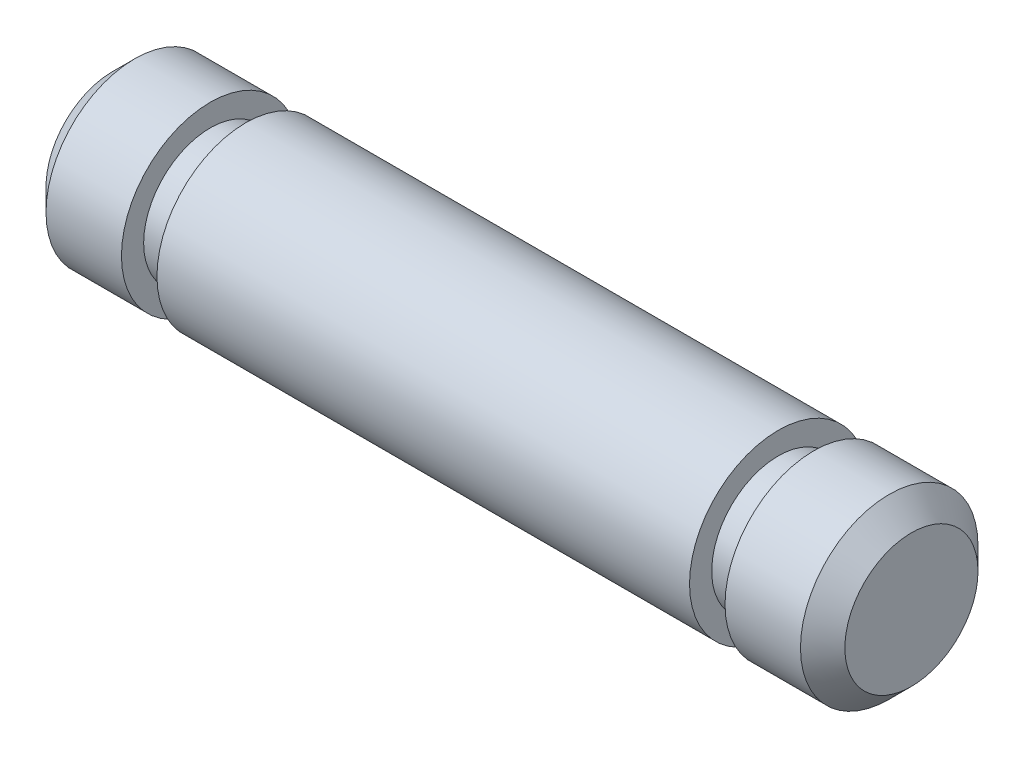
ISO-10303-21;
HEADER;
FILE_DESCRIPTION(('STEP AP214'),'2;1');
FILE_NAME('part.step','',(''),(''),'','','');
FILE_SCHEMA(('AUTOMOTIVE_DESIGN { 1 0 10303 214 1 1 1 1 }'));
ENDSEC;
DATA;
#1=APPLICATION_CONTEXT('core data for automotive mechanical design processes');
#2=APPLICATION_PROTOCOL_DEFINITION('international standard','automotive_design',2000,#1);
#3=PRODUCT_CONTEXT('',#1,'mechanical');
#4=PRODUCT('Part','Part','',(#3));
#5=PRODUCT_RELATED_PRODUCT_CATEGORY('part','',(#4));
#6=PRODUCT_DEFINITION_FORMATION('','',#4);
#7=PRODUCT_DEFINITION_CONTEXT('part definition',#1,'design');
#8=PRODUCT_DEFINITION('design','',#6,#7);
#9=PRODUCT_DEFINITION_SHAPE('','',#8);
#10=(LENGTH_UNIT() NAMED_UNIT(*) SI_UNIT(.MILLI.,.METRE.));
#11=(NAMED_UNIT(*) PLANE_ANGLE_UNIT() SI_UNIT($,.RADIAN.));
#12=(NAMED_UNIT(*) SI_UNIT($,.STERADIAN.) SOLID_ANGLE_UNIT());
#13=UNCERTAINTY_MEASURE_WITH_UNIT(LENGTH_MEASURE(1.E-05),#10,'distance_accuracy_value','');
#14=(GEOMETRIC_REPRESENTATION_CONTEXT(3) GLOBAL_UNCERTAINTY_ASSIGNED_CONTEXT((#13)) GLOBAL_UNIT_ASSIGNED_CONTEXT((#10,
#11,#12)) REPRESENTATION_CONTEXT('',''));
#15=CARTESIAN_POINT('',(0.,0.,0.));
#16=DIRECTION('',(0.,0.,1.));
#17=DIRECTION('',(1.,0.,0.));
#18=AXIS2_PLACEMENT_3D('',#15,#16,#17);
#19=CARTESIAN_POINT('',(18.,0.,0.));
#20=DIRECTION('',(-1.,0.,0.));
#21=DIRECTION('',(0.,0.,1.));
#22=AXIS2_PLACEMENT_3D('',#19,#20,#21);
#23=CYLINDRICAL_SURFACE('',#22,2.);
#24=CARTESIAN_POINT('',(15.,0.,0.));
#25=DIRECTION('',(1.,0.,0.));
#26=DIRECTION('',(0.,0.,-1.));
#27=AXIS2_PLACEMENT_3D('',#24,#25,#26);
#28=CIRCLE('',#27,2.);
#29=CARTESIAN_POINT('',(15.,0.,-2.));
#30=VERTEX_POINT('',#29);
#31=EDGE_CURVE('E67',#30,#30,#28,.T.);
#32=ORIENTED_EDGE('',*,*,#31,.F.);
#33=EDGE_LOOP('',(#32));
#34=FACE_BOUND('',#33,.T.);
#35=CARTESIAN_POINT('',(3.,0.,0.));
#36=DIRECTION('',(-1.,0.,0.));
#37=DIRECTION('',(0.,0.,1.));
#38=AXIS2_PLACEMENT_3D('',#35,#36,#37);
#39=CIRCLE('',#38,2.);
#40=CARTESIAN_POINT('',(3.,0.,2.));
#41=VERTEX_POINT('',#40);
#42=EDGE_CURVE('E83',#41,#41,#39,.T.);
#43=ORIENTED_EDGE('',*,*,#42,.F.);
#44=EDGE_LOOP('',(#43));
#45=FACE_BOUND('',#44,.T.);
#46=ADVANCED_FACE('F41',(#34,#45),#23,.T.);
#47=CARTESIAN_POINT('',(15.8,0.,0.));
#48=DIRECTION('',(1.,0.,0.));
#49=DIRECTION('',(0.,0.,-1.));
#50=AXIS2_PLACEMENT_3D('',#47,#48,#49);
#51=CIRCLE('',#50,2.);
#52=CARTESIAN_POINT('',(15.8,0.,-2.));
#53=VERTEX_POINT('',#52);
#54=EDGE_CURVE('E66',#53,#53,#51,.T.);
#55=ORIENTED_EDGE('',*,*,#54,.T.);
#56=EDGE_LOOP('',(#55));
#57=FACE_BOUND('',#56,.T.);
#58=CARTESIAN_POINT('',(17.5,0.,0.));
#59=DIRECTION('',(1.,0.,0.));
#60=DIRECTION('',(0.,0.,-1.));
#61=AXIS2_PLACEMENT_3D('',#58,#59,#60);
#62=CIRCLE('',#61,2.);
#63=CARTESIAN_POINT('',(17.5,0.,-2.));
#64=VERTEX_POINT('',#63);
#65=EDGE_CURVE('E60',#64,#64,#62,.F.);
#66=ORIENTED_EDGE('',*,*,#65,.T.);
#67=EDGE_LOOP('',(#66));
#68=FACE_BOUND('',#67,.T.);
#69=ADVANCED_FACE('F120',(#57,#68),#23,.T.);
#70=CARTESIAN_POINT('',(18.,0.,0.));
#71=DIRECTION('',(1.,0.,0.));
#72=DIRECTION('',(0.,0.,-1.));
#73=AXIS2_PLACEMENT_3D('',#70,#71,#72);
#74=PLANE('',#73);
#75=CARTESIAN_POINT('',(18.,0.,0.));
#76=DIRECTION('',(1.,0.,0.));
#77=DIRECTION('',(0.,0.,-1.));
#78=AXIS2_PLACEMENT_3D('',#75,#76,#77);
#79=CIRCLE('',#78,1.5);
#80=CARTESIAN_POINT('',(18.,0.,-1.5));
#81=VERTEX_POINT('',#80);
#82=EDGE_CURVE('E10',#81,#81,#79,.T.);
#83=ORIENTED_EDGE('',*,*,#82,.T.);
#84=EDGE_LOOP('',(#83));
#85=FACE_BOUND('',#84,.T.);
#86=ADVANCED_FACE('F127',(#85),#74,.T.);
#87=CARTESIAN_POINT('',(18.,0.,0.));
#88=DIRECTION('',(-1.,0.,0.));
#89=DIRECTION('',(0.,0.,1.));
#90=AXIS2_PLACEMENT_3D('',#87,#88,#89);
#91=CONICAL_SURFACE('',#90,1.5,0.785398163397445);
#92=ORIENTED_EDGE('',*,*,#65,.F.);
#93=EDGE_LOOP('',(#92));
#94=FACE_BOUND('',#93,.T.);
#95=ORIENTED_EDGE('',*,*,#82,.F.);
#96=EDGE_LOOP('',(#95));
#97=FACE_BOUND('',#96,.T.);
#98=ADVANCED_FACE('F44',(#94,#97),#91,.T.);
#99=CARTESIAN_POINT('',(15.8,0.,0.));
#100=DIRECTION('',(1.,0.,0.));
#101=DIRECTION('',(0.,0.,-1.));
#102=AXIS2_PLACEMENT_3D('',#99,#100,#101);
#103=PLANE('',#102);
#104=ORIENTED_EDGE('',*,*,#54,.F.);
#105=EDGE_LOOP('',(#104));
#106=FACE_BOUND('',#105,.T.);
#107=CARTESIAN_POINT('',(15.8,0.,0.));
#108=DIRECTION('',(1.,0.,0.));
#109=DIRECTION('',(0.,0.,-1.));
#110=AXIS2_PLACEMENT_3D('',#107,#108,#109);
#111=CIRCLE('',#110,1.5);
#112=CARTESIAN_POINT('',(15.8,0.,-1.5));
#113=VERTEX_POINT('',#112);
#114=EDGE_CURVE('E71',#113,#113,#111,.T.);
#115=ORIENTED_EDGE('',*,*,#114,.T.);
#116=EDGE_LOOP('',(#115));
#117=FACE_BOUND('',#116,.T.);
#118=ADVANCED_FACE('F159',(#106,#117),#103,.F.);
#119=CARTESIAN_POINT('',(15.,0.,0.));
#120=DIRECTION('',(1.,0.,0.));
#121=DIRECTION('',(0.,0.,-1.));
#122=AXIS2_PLACEMENT_3D('',#119,#120,#121);
#123=PLANE('',#122);
#124=ORIENTED_EDGE('',*,*,#31,.T.);
#125=EDGE_LOOP('',(#124));
#126=FACE_BOUND('',#125,.T.);
#127=CARTESIAN_POINT('',(15.,0.,0.));
#128=DIRECTION('',(1.,0.,0.));
#129=DIRECTION('',(0.,0.,-1.));
#130=AXIS2_PLACEMENT_3D('',#127,#128,#129);
#131=CIRCLE('',#130,1.5);
#132=CARTESIAN_POINT('',(15.,0.,-1.5));
#133=VERTEX_POINT('',#132);
#134=EDGE_CURVE('E75',#133,#133,#131,.T.);
#135=ORIENTED_EDGE('',*,*,#134,.F.);
#136=EDGE_LOOP('',(#135));
#137=FACE_BOUND('',#136,.T.);
#138=ADVANCED_FACE('F156',(#126,#137),#123,.T.);
#139=CARTESIAN_POINT('',(15.8,0.,0.));
#140=DIRECTION('',(-1.,0.,0.));
#141=DIRECTION('',(0.,0.,1.));
#142=AXIS2_PLACEMENT_3D('',#139,#140,#141);
#143=CYLINDRICAL_SURFACE('',#142,1.5);
#144=ORIENTED_EDGE('',*,*,#114,.F.);
#145=EDGE_LOOP('',(#144));
#146=FACE_BOUND('',#145,.T.);
#147=ORIENTED_EDGE('',*,*,#134,.T.);
#148=EDGE_LOOP('',(#147));
#149=FACE_BOUND('',#148,.T.);
#150=ADVANCED_FACE('F115',(#146,#149),#143,.T.);
#151=CARTESIAN_POINT('',(2.2,0.,0.));
#152=DIRECTION('',(-1.,0.,0.));
#153=DIRECTION('',(0.,0.,1.));
#154=AXIS2_PLACEMENT_3D('',#151,#152,#153);
#155=PLANE('',#154);
#156=CARTESIAN_POINT('',(2.2,0.,0.));
#157=DIRECTION('',(-1.,0.,0.));
#158=DIRECTION('',(0.,0.,1.));
#159=AXIS2_PLACEMENT_3D('',#156,#157,#158);
#160=CIRCLE('',#159,2.);
#161=CARTESIAN_POINT('',(2.2,0.,2.));
#162=VERTEX_POINT('',#161);
#163=EDGE_CURVE('E79',#162,#162,#160,.T.);
#164=ORIENTED_EDGE('',*,*,#163,.F.);
#165=EDGE_LOOP('',(#164));
#166=FACE_BOUND('',#165,.T.);
#167=CARTESIAN_POINT('',(2.2,0.,0.));
#168=DIRECTION('',(-1.,0.,0.));
#169=DIRECTION('',(0.,0.,1.));
#170=AXIS2_PLACEMENT_3D('',#167,#168,#169);
#171=CIRCLE('',#170,1.49999999999999);
#172=CARTESIAN_POINT('',(2.2,0.,1.49999999999999));
#173=VERTEX_POINT('',#172);
#174=EDGE_CURVE('E87',#173,#173,#171,.T.);
#175=ORIENTED_EDGE('',*,*,#174,.T.);
#176=EDGE_LOOP('',(#175));
#177=FACE_BOUND('',#176,.T.);
#178=ADVANCED_FACE('F99',(#166,#177),#155,.F.);
#179=CARTESIAN_POINT('',(3.,0.,0.));
#180=DIRECTION('',(-1.,0.,0.));
#181=DIRECTION('',(0.,0.,1.));
#182=AXIS2_PLACEMENT_3D('',#179,#180,#181);
#183=PLANE('',#182);
#184=ORIENTED_EDGE('',*,*,#42,.T.);
#185=EDGE_LOOP('',(#184));
#186=FACE_BOUND('',#185,.T.);
#187=CARTESIAN_POINT('',(3.,0.,0.));
#188=DIRECTION('',(-1.,0.,0.));
#189=DIRECTION('',(0.,0.,1.));
#190=AXIS2_PLACEMENT_3D('',#187,#188,#189);
#191=CIRCLE('',#190,1.49999999999999);
#192=CARTESIAN_POINT('',(3.,0.,1.49999999999999));
#193=VERTEX_POINT('',#192);
#194=EDGE_CURVE('E91',#193,#193,#191,.T.);
#195=ORIENTED_EDGE('',*,*,#194,.F.);
#196=EDGE_LOOP('',(#195));
#197=FACE_BOUND('',#196,.T.);
#198=ADVANCED_FACE('F105',(#186,#197),#183,.T.);
#199=CARTESIAN_POINT('',(2.2,0.,0.));
#200=DIRECTION('',(1.,0.,0.));
#201=DIRECTION('',(0.,0.,-1.));
#202=AXIS2_PLACEMENT_3D('',#199,#200,#201);
#203=CYLINDRICAL_SURFACE('',#202,1.49999999999999);
#204=ORIENTED_EDGE('',*,*,#174,.F.);
#205=EDGE_LOOP('',(#204));
#206=FACE_BOUND('',#205,.T.);
#207=ORIENTED_EDGE('',*,*,#194,.T.);
#208=EDGE_LOOP('',(#207));
#209=FACE_BOUND('',#208,.T.);
#210=ADVANCED_FACE('F101',(#206,#209),#203,.T.);
#211=CARTESIAN_POINT('',(0.,0.,0.));
#212=DIRECTION('',(1.,0.,0.));
#213=DIRECTION('',(0.,0.,-1.));
#214=AXIS2_PLACEMENT_3D('',#211,#212,#213);
#215=PLANE('',#214);
#216=CARTESIAN_POINT('',(0.,0.,0.));
#217=DIRECTION('',(1.,0.,0.));
#218=DIRECTION('',(0.,0.,-1.));
#219=AXIS2_PLACEMENT_3D('',#216,#217,#218);
#220=CIRCLE('',#219,1.49999999999999);
#221=CARTESIAN_POINT('',(0.,0.,-1.49999999999999));
#222=VERTEX_POINT('',#221);
#223=EDGE_CURVE('E50',#222,#222,#220,.F.);
#224=ORIENTED_EDGE('',*,*,#223,.T.);
#225=EDGE_LOOP('',(#224));
#226=FACE_BOUND('',#225,.T.);
#227=ADVANCED_FACE('F104',(#226),#215,.F.);
#228=CARTESIAN_POINT('',(0.500000000000004,0.,0.));
#229=DIRECTION('',(1.,0.,0.));
#230=DIRECTION('',(0.,0.,-1.));
#231=AXIS2_PLACEMENT_3D('',#228,#229,#230);
#232=CONICAL_SURFACE('',#231,2.,0.785398163397452);
#233=ORIENTED_EDGE('',*,*,#223,.F.);
#234=EDGE_LOOP('',(#233));
#235=FACE_BOUND('',#234,.T.);
#236=CARTESIAN_POINT('',(0.500000000000004,0.,0.));
#237=DIRECTION('',(1.,0.,0.));
#238=DIRECTION('',(0.,0.,-1.));
#239=AXIS2_PLACEMENT_3D('',#236,#237,#238);
#240=CIRCLE('',#239,2.);
#241=CARTESIAN_POINT('',(0.500000000000004,0.,-2.));
#242=VERTEX_POINT('',#241);
#243=EDGE_CURVE('E55',#242,#242,#240,.T.);
#244=ORIENTED_EDGE('',*,*,#243,.F.);
#245=EDGE_LOOP('',(#244));
#246=FACE_BOUND('',#245,.T.);
#247=ADVANCED_FACE('F133',(#235,#246),#232,.T.);
#248=ORIENTED_EDGE('',*,*,#163,.T.);
#249=EDGE_LOOP('',(#248));
#250=FACE_BOUND('',#249,.T.);
#251=ORIENTED_EDGE('',*,*,#243,.T.);
#252=EDGE_LOOP('',(#251));
#253=FACE_BOUND('',#252,.T.);
#254=ADVANCED_FACE('F123',(#250,#253),#23,.T.);
#255=CLOSED_SHELL('',(#46,#69,#86,#98,#118,#138,#150,#178,#198,#210,#227,#247,#254));
#256=MANIFOLD_SOLID_BREP('B2',#255);
#257=ADVANCED_BREP_SHAPE_REPRESENTATION('',(#18,#256),#14);
#258=SHAPE_DEFINITION_REPRESENTATION(#9,#257);
ENDSEC;
END-ISO-10303-21;
